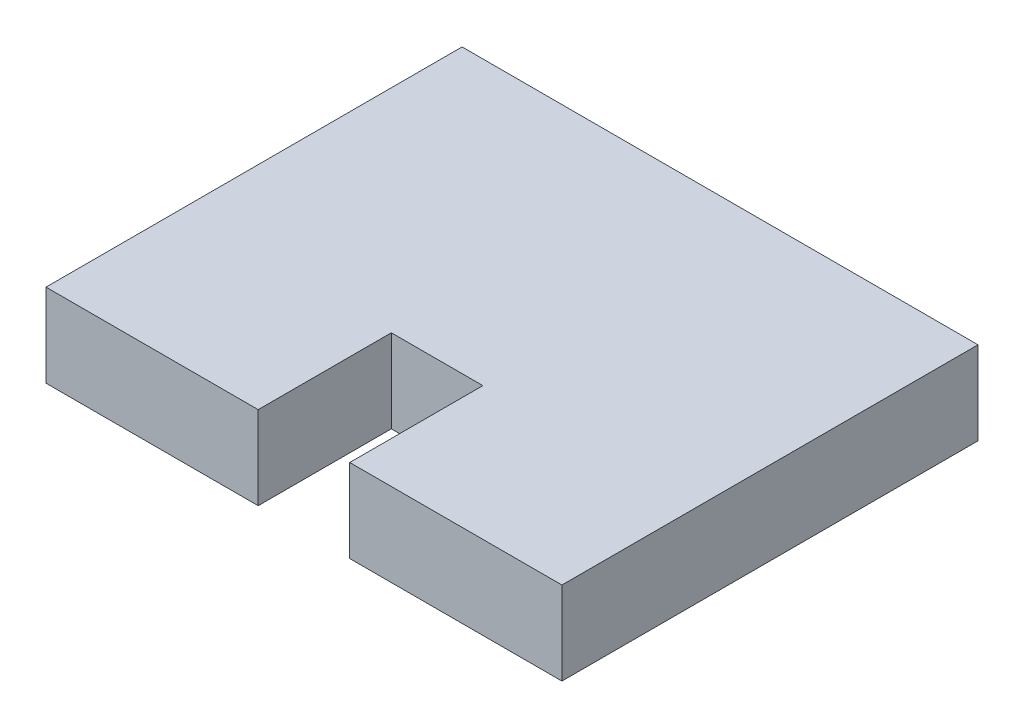
ISO-10303-21;
HEADER;
FILE_DESCRIPTION(('STEP AP214'),'2;1');
FILE_NAME('part.step','',(''),(''),'','','');
FILE_SCHEMA(('AUTOMOTIVE_DESIGN { 1 0 10303 214 1 1 1 1 }'));
ENDSEC;
DATA;
#1=APPLICATION_CONTEXT('core data for automotive mechanical design processes');
#2=APPLICATION_PROTOCOL_DEFINITION('international standard','automotive_design',2000,#1);
#3=PRODUCT_CONTEXT('',#1,'mechanical');
#4=PRODUCT('Part','Part','',(#3));
#5=PRODUCT_RELATED_PRODUCT_CATEGORY('part','',(#4));
#6=PRODUCT_DEFINITION_FORMATION('','',#4);
#7=PRODUCT_DEFINITION_CONTEXT('part definition',#1,'design');
#8=PRODUCT_DEFINITION('design','',#6,#7);
#9=PRODUCT_DEFINITION_SHAPE('','',#8);
#10=(LENGTH_UNIT() NAMED_UNIT(*) SI_UNIT(.MILLI.,.METRE.));
#11=(NAMED_UNIT(*) PLANE_ANGLE_UNIT() SI_UNIT($,.RADIAN.));
#12=(NAMED_UNIT(*) SI_UNIT($,.STERADIAN.) SOLID_ANGLE_UNIT());
#13=UNCERTAINTY_MEASURE_WITH_UNIT(LENGTH_MEASURE(1.E-05),#10,'distance_accuracy_value','');
#14=(GEOMETRIC_REPRESENTATION_CONTEXT(3) GLOBAL_UNCERTAINTY_ASSIGNED_CONTEXT((#13)) GLOBAL_UNIT_ASSIGNED_CONTEXT((#10,
#11,#12)) REPRESENTATION_CONTEXT('',''));
#15=CARTESIAN_POINT('',(0.,0.,0.));
#16=DIRECTION('',(0.,0.,1.));
#17=DIRECTION('',(1.,0.,0.));
#18=AXIS2_PLACEMENT_3D('',#15,#16,#17);
#19=CARTESIAN_POINT('',(-15.5,5.,12.5));
#20=DIRECTION('',(0.,0.,-1.));
#21=DIRECTION('',(-1.,0.,0.));
#22=AXIS2_PLACEMENT_3D('',#19,#20,#21);
#23=PLANE('',#22);
#24=DIRECTION('',(1.,0.,0.));
#25=VECTOR('',#24,1.);
#26=CARTESIAN_POINT('',(-15.5,5.,12.5));
#27=LINE('',#26,#25);
#28=CARTESIAN_POINT('',(2.75,5.,12.5));
#29=VERTEX_POINT('',#28);
#30=CARTESIAN_POINT('',(15.5,5.,12.5));
#31=VERTEX_POINT('',#30);
#32=EDGE_CURVE('E68',#29,#31,#27,.T.);
#33=ORIENTED_EDGE('',*,*,#32,.F.);
#34=DIRECTION('',(0.,1.,0.));
#35=VECTOR('',#34,1.);
#36=CARTESIAN_POINT('',(2.75,0.,12.5));
#37=LINE('',#36,#35);
#38=CARTESIAN_POINT('',(2.75,0.,12.5));
#39=VERTEX_POINT('',#38);
#40=EDGE_CURVE('E151',#39,#29,#37,.T.);
#41=ORIENTED_EDGE('',*,*,#40,.F.);
#42=DIRECTION('',(1.,0.,0.));
#43=VECTOR('',#42,1.);
#44=CARTESIAN_POINT('',(-15.5,0.,12.5));
#45=LINE('',#44,#43);
#46=CARTESIAN_POINT('',(15.5,0.,12.5));
#47=VERTEX_POINT('',#46);
#48=EDGE_CURVE('E90',#39,#47,#45,.T.);
#49=ORIENTED_EDGE('',*,*,#48,.T.);
#50=DIRECTION('',(0.,-1.,0.));
#51=VECTOR('',#50,1.);
#52=CARTESIAN_POINT('',(15.5,5.,12.5));
#53=LINE('',#52,#51);
#54=EDGE_CURVE('E174',#31,#47,#53,.T.);
#55=ORIENTED_EDGE('',*,*,#54,.F.);
#56=EDGE_LOOP('',(#33,#41,#49,#55));
#57=FACE_BOUND('',#56,.T.);
#58=ADVANCED_FACE('F43',(#57),#23,.F.);
#59=CARTESIAN_POINT('',(15.5,5.,12.5));
#60=DIRECTION('',(-1.,0.,0.));
#61=DIRECTION('',(0.,0.,1.));
#62=AXIS2_PLACEMENT_3D('',#59,#60,#61);
#63=PLANE('',#62);
#64=DIRECTION('',(0.,0.,-1.));
#65=VECTOR('',#64,1.);
#66=CARTESIAN_POINT('',(15.5,0.,12.5));
#67=LINE('',#66,#65);
#68=CARTESIAN_POINT('',(15.5,0.,-12.5));
#69=VERTEX_POINT('',#68);
#70=EDGE_CURVE('E154',#47,#69,#67,.T.);
#71=ORIENTED_EDGE('',*,*,#70,.T.);
#72=DIRECTION('',(0.,-1.,0.));
#73=VECTOR('',#72,1.);
#74=CARTESIAN_POINT('',(15.5,5.,-12.5));
#75=LINE('',#74,#73);
#76=CARTESIAN_POINT('',(15.5,5.,-12.5));
#77=VERTEX_POINT('',#76);
#78=EDGE_CURVE('E11',#77,#69,#75,.T.);
#79=ORIENTED_EDGE('',*,*,#78,.F.);
#80=DIRECTION('',(0.,0.,-1.));
#81=VECTOR('',#80,1.);
#82=CARTESIAN_POINT('',(15.5,5.,12.5));
#83=LINE('',#82,#81);
#84=EDGE_CURVE('E161',#31,#77,#83,.T.);
#85=ORIENTED_EDGE('',*,*,#84,.F.);
#86=ORIENTED_EDGE('',*,*,#54,.T.);
#87=EDGE_LOOP('',(#71,#79,#85,#86));
#88=FACE_BOUND('',#87,.T.);
#89=ADVANCED_FACE('F45',(#88),#63,.F.);
#90=CARTESIAN_POINT('',(-15.5,5.,-12.5));
#91=DIRECTION('',(0.,0.,1.));
#92=DIRECTION('',(1.,0.,0.));
#93=AXIS2_PLACEMENT_3D('',#90,#91,#92);
#94=PLANE('',#93);
#95=DIRECTION('',(-1.,0.,0.));
#96=VECTOR('',#95,1.);
#97=CARTESIAN_POINT('',(-15.5,0.,-12.5));
#98=LINE('',#97,#96);
#99=CARTESIAN_POINT('',(-15.5,0.,-12.5));
#100=VERTEX_POINT('',#99);
#101=EDGE_CURVE('E178',#69,#100,#98,.T.);
#102=ORIENTED_EDGE('',*,*,#101,.T.);
#103=DIRECTION('',(0.,-1.,0.));
#104=VECTOR('',#103,1.);
#105=CARTESIAN_POINT('',(-15.5,5.,-12.5));
#106=LINE('',#105,#104);
#107=CARTESIAN_POINT('',(-15.5,5.,-12.5));
#108=VERTEX_POINT('',#107);
#109=EDGE_CURVE('E52',#108,#100,#106,.T.);
#110=ORIENTED_EDGE('',*,*,#109,.F.);
#111=DIRECTION('',(-1.,0.,0.));
#112=VECTOR('',#111,1.);
#113=CARTESIAN_POINT('',(-15.5,5.,-12.5));
#114=LINE('',#113,#112);
#115=EDGE_CURVE('E97',#77,#108,#114,.T.);
#116=ORIENTED_EDGE('',*,*,#115,.F.);
#117=ORIENTED_EDGE('',*,*,#78,.T.);
#118=EDGE_LOOP('',(#102,#110,#116,#117));
#119=FACE_BOUND('',#118,.T.);
#120=ADVANCED_FACE('F208',(#119),#94,.F.);
#121=CARTESIAN_POINT('',(-15.5,5.,12.5));
#122=DIRECTION('',(1.,0.,0.));
#123=DIRECTION('',(0.,0.,-1.));
#124=AXIS2_PLACEMENT_3D('',#121,#122,#123);
#125=PLANE('',#124);
#126=DIRECTION('',(0.,0.,1.));
#127=VECTOR('',#126,1.);
#128=CARTESIAN_POINT('',(-15.5,0.,12.5));
#129=LINE('',#128,#127);
#130=CARTESIAN_POINT('',(-15.5,0.,12.5));
#131=VERTEX_POINT('',#130);
#132=EDGE_CURVE('E181',#100,#131,#129,.T.);
#133=ORIENTED_EDGE('',*,*,#132,.T.);
#134=DIRECTION('',(0.,-1.,0.));
#135=VECTOR('',#134,1.);
#136=CARTESIAN_POINT('',(-15.5,5.,12.5));
#137=LINE('',#136,#135);
#138=CARTESIAN_POINT('',(-15.5,5.,12.5));
#139=VERTEX_POINT('',#138);
#140=EDGE_CURVE('E189',#139,#131,#137,.T.);
#141=ORIENTED_EDGE('',*,*,#140,.F.);
#142=DIRECTION('',(0.,0.,1.));
#143=VECTOR('',#142,1.);
#144=CARTESIAN_POINT('',(-15.5,5.,12.5));
#145=LINE('',#144,#143);
#146=EDGE_CURVE('E167',#108,#139,#145,.T.);
#147=ORIENTED_EDGE('',*,*,#146,.F.);
#148=ORIENTED_EDGE('',*,*,#109,.T.);
#149=EDGE_LOOP('',(#133,#141,#147,#148));
#150=FACE_BOUND('',#149,.T.);
#151=ADVANCED_FACE('F197',(#150),#125,.F.);
#152=CARTESIAN_POINT('',(-2.75,0.,12.5));
#153=VERTEX_POINT('',#152);
#154=EDGE_CURVE('E164',#131,#153,#45,.T.);
#155=ORIENTED_EDGE('',*,*,#154,.T.);
#156=DIRECTION('',(0.,1.,0.));
#157=VECTOR('',#156,1.);
#158=CARTESIAN_POINT('',(-2.75,0.,12.5));
#159=LINE('',#158,#157);
#160=CARTESIAN_POINT('',(-2.75,5.,12.5));
#161=VERTEX_POINT('',#160);
#162=EDGE_CURVE('E155',#153,#161,#159,.T.);
#163=ORIENTED_EDGE('',*,*,#162,.T.);
#164=EDGE_CURVE('E170',#139,#161,#27,.T.);
#165=ORIENTED_EDGE('',*,*,#164,.F.);
#166=ORIENTED_EDGE('',*,*,#140,.T.);
#167=EDGE_LOOP('',(#155,#163,#165,#166));
#168=FACE_BOUND('',#167,.T.);
#169=ADVANCED_FACE('F201',(#168),#23,.F.);
#170=CARTESIAN_POINT('',(0.,5.,0.));
#171=DIRECTION('',(0.,-1.,0.));
#172=DIRECTION('',(0.,0.,-1.));
#173=AXIS2_PLACEMENT_3D('',#170,#171,#172);
#174=PLANE('',#173);
#175=DIRECTION('',(-1.,0.,0.));
#176=VECTOR('',#175,1.);
#177=CARTESIAN_POINT('',(-2.75,5.,4.5));
#178=LINE('',#177,#176);
#179=CARTESIAN_POINT('',(2.75,5.,4.5));
#180=VERTEX_POINT('',#179);
#181=CARTESIAN_POINT('',(-2.75,5.,4.5));
#182=VERTEX_POINT('',#181);
#183=EDGE_CURVE('E142',#180,#182,#178,.T.);
#184=ORIENTED_EDGE('',*,*,#183,.F.);
#185=DIRECTION('',(0.,0.,-1.));
#186=VECTOR('',#185,1.);
#187=CARTESIAN_POINT('',(2.75,5.,12.5));
#188=LINE('',#187,#186);
#189=EDGE_CURVE('E123',#29,#180,#188,.T.);
#190=ORIENTED_EDGE('',*,*,#189,.F.);
#191=ORIENTED_EDGE('',*,*,#32,.T.);
#192=ORIENTED_EDGE('',*,*,#84,.T.);
#193=ORIENTED_EDGE('',*,*,#115,.T.);
#194=ORIENTED_EDGE('',*,*,#146,.T.);
#195=ORIENTED_EDGE('',*,*,#164,.T.);
#196=DIRECTION('',(0.,0.,1.));
#197=VECTOR('',#196,1.);
#198=CARTESIAN_POINT('',(-2.75,5.,12.5));
#199=LINE('',#198,#197);
#200=EDGE_CURVE('E139',#182,#161,#199,.T.);
#201=ORIENTED_EDGE('',*,*,#200,.F.);
#202=EDGE_LOOP('',(#184,#190,#191,#192,#193,#194,#195,#201));
#203=FACE_BOUND('',#202,.T.);
#204=ADVANCED_FACE('F204',(#203),#174,.F.);
#205=CARTESIAN_POINT('',(0.,0.,0.));
#206=DIRECTION('',(0.,-1.,0.));
#207=DIRECTION('',(0.,0.,-1.));
#208=AXIS2_PLACEMENT_3D('',#205,#206,#207);
#209=PLANE('',#208);
#210=DIRECTION('',(0.,0.,-1.));
#211=VECTOR('',#210,1.);
#212=CARTESIAN_POINT('',(2.75,0.,12.5));
#213=LINE('',#212,#211);
#214=CARTESIAN_POINT('',(2.75,0.,4.5));
#215=VERTEX_POINT('',#214);
#216=EDGE_CURVE('E122',#39,#215,#213,.T.);
#217=ORIENTED_EDGE('',*,*,#216,.T.);
#218=DIRECTION('',(-1.,0.,0.));
#219=VECTOR('',#218,1.);
#220=CARTESIAN_POINT('',(-2.75,0.,4.5));
#221=LINE('',#220,#219);
#222=CARTESIAN_POINT('',(-2.75,0.,4.5));
#223=VERTEX_POINT('',#222);
#224=EDGE_CURVE('E131',#215,#223,#221,.T.);
#225=ORIENTED_EDGE('',*,*,#224,.T.);
#226=DIRECTION('',(0.,0.,1.));
#227=VECTOR('',#226,1.);
#228=CARTESIAN_POINT('',(-2.75,0.,12.5));
#229=LINE('',#228,#227);
#230=EDGE_CURVE('E59',#223,#153,#229,.T.);
#231=ORIENTED_EDGE('',*,*,#230,.T.);
#232=ORIENTED_EDGE('',*,*,#154,.F.);
#233=ORIENTED_EDGE('',*,*,#132,.F.);
#234=ORIENTED_EDGE('',*,*,#101,.F.);
#235=ORIENTED_EDGE('',*,*,#70,.F.);
#236=ORIENTED_EDGE('',*,*,#48,.F.);
#237=EDGE_LOOP('',(#217,#225,#231,#232,#233,#234,#235,#236));
#238=FACE_BOUND('',#237,.T.);
#239=ADVANCED_FACE('F136',(#238),#209,.T.);
#240=CARTESIAN_POINT('',(2.75,0.,12.5));
#241=DIRECTION('',(1.,0.,0.));
#242=DIRECTION('',(0.,0.,-1.));
#243=AXIS2_PLACEMENT_3D('',#240,#241,#242);
#244=PLANE('',#243);
#245=ORIENTED_EDGE('',*,*,#189,.T.);
#246=DIRECTION('',(0.,1.,0.));
#247=VECTOR('',#246,1.);
#248=CARTESIAN_POINT('',(2.75,0.,4.5));
#249=LINE('',#248,#247);
#250=EDGE_CURVE('E118',#215,#180,#249,.T.);
#251=ORIENTED_EDGE('',*,*,#250,.F.);
#252=ORIENTED_EDGE('',*,*,#216,.F.);
#253=ORIENTED_EDGE('',*,*,#40,.T.);
#254=EDGE_LOOP('',(#245,#251,#252,#253));
#255=FACE_BOUND('',#254,.T.);
#256=ADVANCED_FACE('F120',(#255),#244,.F.);
#257=CARTESIAN_POINT('',(-2.75,0.,12.5));
#258=DIRECTION('',(-1.,0.,0.));
#259=DIRECTION('',(0.,0.,1.));
#260=AXIS2_PLACEMENT_3D('',#257,#258,#259);
#261=PLANE('',#260);
#262=ORIENTED_EDGE('',*,*,#200,.T.);
#263=ORIENTED_EDGE('',*,*,#162,.F.);
#264=ORIENTED_EDGE('',*,*,#230,.F.);
#265=DIRECTION('',(0.,1.,0.));
#266=VECTOR('',#265,1.);
#267=CARTESIAN_POINT('',(-2.75,0.,4.5));
#268=LINE('',#267,#266);
#269=EDGE_CURVE('E128',#223,#182,#268,.T.);
#270=ORIENTED_EDGE('',*,*,#269,.T.);
#271=EDGE_LOOP('',(#262,#263,#264,#270));
#272=FACE_BOUND('',#271,.T.);
#273=ADVANCED_FACE('F231',(#272),#261,.F.);
#274=CARTESIAN_POINT('',(-2.75,0.,4.5));
#275=DIRECTION('',(0.,0.,-1.));
#276=DIRECTION('',(-1.,0.,0.));
#277=AXIS2_PLACEMENT_3D('',#274,#275,#276);
#278=PLANE('',#277);
#279=ORIENTED_EDGE('',*,*,#183,.T.);
#280=ORIENTED_EDGE('',*,*,#269,.F.);
#281=ORIENTED_EDGE('',*,*,#224,.F.);
#282=ORIENTED_EDGE('',*,*,#250,.T.);
#283=EDGE_LOOP('',(#279,#280,#281,#282));
#284=FACE_BOUND('',#283,.T.);
#285=ADVANCED_FACE('F132',(#284),#278,.F.);
#286=CLOSED_SHELL('',(#58,#89,#120,#151,#169,#204,#239,#256,#273,#285));
#287=MANIFOLD_SOLID_BREP('B2',#286);
#288=ADVANCED_BREP_SHAPE_REPRESENTATION('',(#18,#287),#14);
#289=SHAPE_DEFINITION_REPRESENTATION(#9,#288);
ENDSEC;
END-ISO-10303-21;
